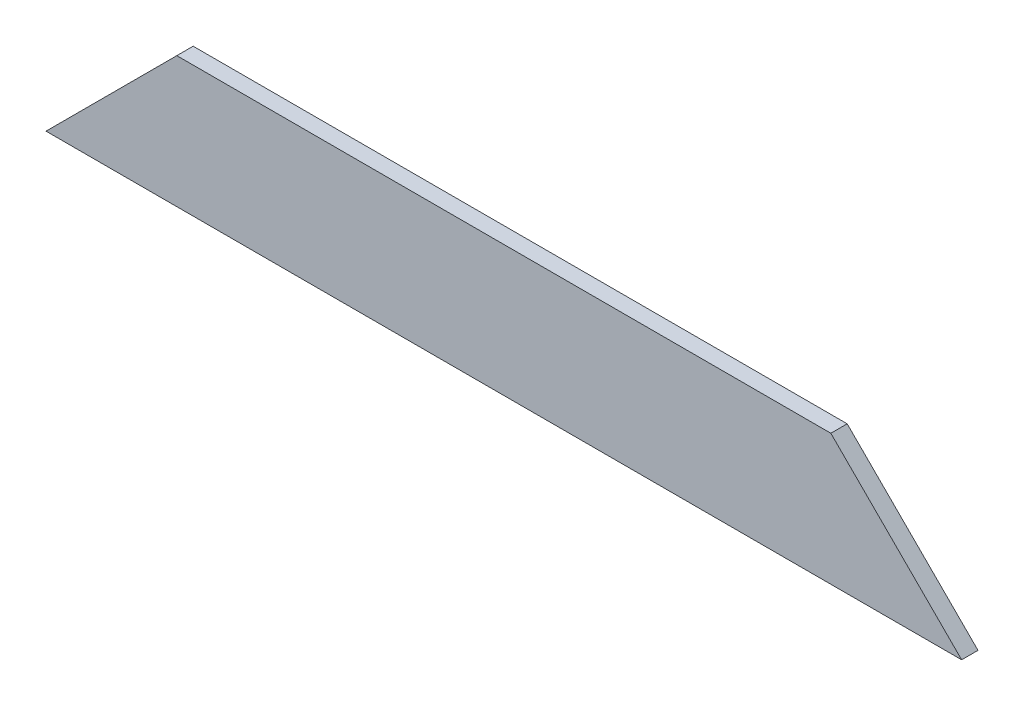
ISO-10303-21;
HEADER;
FILE_DESCRIPTION(('STEP AP214'),'2;1');
FILE_NAME('part.step','',(''),(''),'','','');
FILE_SCHEMA(('AUTOMOTIVE_DESIGN { 1 0 10303 214 1 1 1 1 }'));
ENDSEC;
DATA;
#1=APPLICATION_CONTEXT('core data for automotive mechanical design processes');
#2=APPLICATION_PROTOCOL_DEFINITION('international standard','automotive_design',2000,#1);
#3=PRODUCT_CONTEXT('',#1,'mechanical');
#4=PRODUCT('Part','Part','',(#3));
#5=PRODUCT_RELATED_PRODUCT_CATEGORY('part','',(#4));
#6=PRODUCT_DEFINITION_FORMATION('','',#4);
#7=PRODUCT_DEFINITION_CONTEXT('part definition',#1,'design');
#8=PRODUCT_DEFINITION('design','',#6,#7);
#9=PRODUCT_DEFINITION_SHAPE('','',#8);
#10=(LENGTH_UNIT() NAMED_UNIT(*) SI_UNIT(.MILLI.,.METRE.));
#11=(NAMED_UNIT(*) PLANE_ANGLE_UNIT() SI_UNIT($,.RADIAN.));
#12=(NAMED_UNIT(*) SI_UNIT($,.STERADIAN.) SOLID_ANGLE_UNIT());
#13=UNCERTAINTY_MEASURE_WITH_UNIT(LENGTH_MEASURE(1.E-05),#10,'distance_accuracy_value','');
#14=(GEOMETRIC_REPRESENTATION_CONTEXT(3) GLOBAL_UNCERTAINTY_ASSIGNED_CONTEXT((#13)) GLOBAL_UNIT_ASSIGNED_CONTEXT((#10,
#11,#12)) REPRESENTATION_CONTEXT('',''));
#15=CARTESIAN_POINT('',(0.,0.,0.));
#16=DIRECTION('',(0.,0.,1.));
#17=DIRECTION('',(1.,0.,0.));
#18=AXIS2_PLACEMENT_3D('',#15,#16,#17);
#19=CARTESIAN_POINT('',(0.,0.,3.175));
#20=DIRECTION('',(0.,0.,1.));
#21=DIRECTION('',(1.,0.,0.));
#22=AXIS2_PLACEMENT_3D('',#19,#20,#21);
#23=PLANE('',#22);
#24=DIRECTION('',(1.,0.,0.));
#25=VECTOR('',#24,1.);
#26=CARTESIAN_POINT('',(152.4,25.4,3.175));
#27=LINE('',#26,#25);
#28=CARTESIAN_POINT('',(-152.4,25.4,3.175));
#29=VERTEX_POINT('',#28);
#30=CARTESIAN_POINT('',(101.6,25.4,3.175));
#31=VERTEX_POINT('',#30);
#32=EDGE_CURVE('E68',#29,#31,#27,.T.);
#33=ORIENTED_EDGE('',*,*,#32,.F.);
#34=DIRECTION('',(-0.707106781186548,-0.707106781186548,0.));
#35=VECTOR('',#34,1.);
#36=CARTESIAN_POINT('',(-177.8,0.,3.175));
#37=LINE('',#36,#35);
#38=CARTESIAN_POINT('',(-203.2,-25.4,3.175));
#39=VERTEX_POINT('',#38);
#40=EDGE_CURVE('E20',#39,#29,#37,.F.);
#41=ORIENTED_EDGE('',*,*,#40,.F.);
#42=DIRECTION('',(1.,0.,0.));
#43=VECTOR('',#42,1.);
#44=CARTESIAN_POINT('',(-203.2,-25.4,3.175));
#45=LINE('',#44,#43);
#46=CARTESIAN_POINT('',(152.4,-25.4,3.175));
#47=VERTEX_POINT('',#46);
#48=EDGE_CURVE('E58',#47,#39,#45,.F.);
#49=ORIENTED_EDGE('',*,*,#48,.F.);
#50=DIRECTION('',(-0.707106781186548,0.707106781186548,0.));
#51=VECTOR('',#50,1.);
#52=CARTESIAN_POINT('',(127.,0.,3.175));
#53=LINE('',#52,#51);
#54=EDGE_CURVE('E53',#31,#47,#53,.F.);
#55=ORIENTED_EDGE('',*,*,#54,.F.);
#56=EDGE_LOOP('',(#33,#41,#49,#55));
#57=FACE_BOUND('',#56,.T.);
#58=ADVANCED_FACE('F17',(#57),#23,.T.);
#59=CARTESIAN_POINT('',(-177.8,0.,0.));
#60=DIRECTION('',(-0.707106781186548,0.707106781186548,0.));
#61=DIRECTION('',(-0.707106781186548,-0.707106781186548,0.));
#62=AXIS2_PLACEMENT_3D('',#59,#60,#61);
#63=PLANE('',#62);
#64=DIRECTION('',(0.,0.,1.));
#65=VECTOR('',#64,1.);
#66=CARTESIAN_POINT('',(-152.4,25.4,-3.175));
#67=LINE('',#66,#65);
#68=CARTESIAN_POINT('',(-152.4,25.4,-3.175));
#69=VERTEX_POINT('',#68);
#70=EDGE_CURVE('E81',#69,#29,#67,.T.);
#71=ORIENTED_EDGE('',*,*,#70,.F.);
#72=DIRECTION('',(-0.707106781186548,-0.707106781186547,0.));
#73=VECTOR('',#72,1.);
#74=CARTESIAN_POINT('',(-152.4,25.4,-3.175));
#75=LINE('',#74,#73);
#76=CARTESIAN_POINT('',(-203.2,-25.4,-3.175));
#77=VERTEX_POINT('',#76);
#78=EDGE_CURVE('E74',#69,#77,#75,.T.);
#79=ORIENTED_EDGE('',*,*,#78,.T.);
#80=DIRECTION('',(0.,0.,-1.));
#81=VECTOR('',#80,1.);
#82=CARTESIAN_POINT('',(-203.2,-25.4,-3.175));
#83=LINE('',#82,#81);
#84=EDGE_CURVE('E63',#39,#77,#83,.T.);
#85=ORIENTED_EDGE('',*,*,#84,.F.);
#86=ORIENTED_EDGE('',*,*,#40,.T.);
#87=EDGE_LOOP('',(#71,#79,#85,#86));
#88=FACE_BOUND('',#87,.T.);
#89=ADVANCED_FACE('F73',(#88),#63,.T.);
#90=CARTESIAN_POINT('',(-203.2,-25.4,-3.175));
#91=DIRECTION('',(0.,-1.,0.));
#92=DIRECTION('',(0.,0.,-1.));
#93=AXIS2_PLACEMENT_3D('',#90,#91,#92);
#94=PLANE('',#93);
#95=ORIENTED_EDGE('',*,*,#48,.T.);
#96=ORIENTED_EDGE('',*,*,#84,.T.);
#97=DIRECTION('',(1.,0.,0.));
#98=VECTOR('',#97,1.);
#99=CARTESIAN_POINT('',(0.,-25.4,-3.175));
#100=LINE('',#99,#98);
#101=CARTESIAN_POINT('',(152.4,-25.4,-3.175));
#102=VERTEX_POINT('',#101);
#103=EDGE_CURVE('E84',#77,#102,#100,.T.);
#104=ORIENTED_EDGE('',*,*,#103,.T.);
#105=DIRECTION('',(0.,0.,1.));
#106=VECTOR('',#105,1.);
#107=CARTESIAN_POINT('',(152.4,-25.4,0.));
#108=LINE('',#107,#106);
#109=EDGE_CURVE('E65',#47,#102,#108,.F.);
#110=ORIENTED_EDGE('',*,*,#109,.F.);
#111=EDGE_LOOP('',(#95,#96,#104,#110));
#112=FACE_BOUND('',#111,.T.);
#113=ADVANCED_FACE('F60',(#112),#94,.T.);
#114=CARTESIAN_POINT('',(127.,0.,0.));
#115=DIRECTION('',(0.707106781186548,0.707106781186548,0.));
#116=DIRECTION('',(-0.707106781186548,0.707106781186548,0.));
#117=AXIS2_PLACEMENT_3D('',#114,#115,#116);
#118=PLANE('',#117);
#119=ORIENTED_EDGE('',*,*,#109,.T.);
#120=DIRECTION('',(-0.707106781186547,0.707106781186548,0.));
#121=VECTOR('',#120,1.);
#122=CARTESIAN_POINT('',(152.4,-25.4,-3.175));
#123=LINE('',#122,#121);
#124=CARTESIAN_POINT('',(101.6,25.4,-3.175));
#125=VERTEX_POINT('',#124);
#126=EDGE_CURVE('E26',#102,#125,#123,.T.);
#127=ORIENTED_EDGE('',*,*,#126,.T.);
#128=DIRECTION('',(0.,0.,1.));
#129=VECTOR('',#128,1.);
#130=CARTESIAN_POINT('',(101.6,25.4,-3.175));
#131=LINE('',#130,#129);
#132=EDGE_CURVE('E34',#31,#125,#131,.F.);
#133=ORIENTED_EDGE('',*,*,#132,.F.);
#134=ORIENTED_EDGE('',*,*,#54,.T.);
#135=EDGE_LOOP('',(#119,#127,#133,#134));
#136=FACE_BOUND('',#135,.T.);
#137=ADVANCED_FACE('F88',(#136),#118,.T.);
#138=CARTESIAN_POINT('',(152.4,25.4,-3.175));
#139=DIRECTION('',(0.,1.,0.));
#140=DIRECTION('',(0.,0.,1.));
#141=AXIS2_PLACEMENT_3D('',#138,#139,#140);
#142=PLANE('',#141);
#143=DIRECTION('',(1.,0.,0.));
#144=VECTOR('',#143,1.);
#145=CARTESIAN_POINT('',(0.,25.4,-3.175));
#146=LINE('',#145,#144);
#147=EDGE_CURVE('E11',#125,#69,#146,.F.);
#148=ORIENTED_EDGE('',*,*,#147,.T.);
#149=ORIENTED_EDGE('',*,*,#70,.T.);
#150=ORIENTED_EDGE('',*,*,#32,.T.);
#151=ORIENTED_EDGE('',*,*,#132,.T.);
#152=EDGE_LOOP('',(#148,#149,#150,#151));
#153=FACE_BOUND('',#152,.T.);
#154=ADVANCED_FACE('F91',(#153),#142,.T.);
#155=CARTESIAN_POINT('',(0.,0.,-3.175));
#156=DIRECTION('',(0.,0.,1.));
#157=DIRECTION('',(1.,0.,0.));
#158=AXIS2_PLACEMENT_3D('',#155,#156,#157);
#159=PLANE('',#158);
#160=ORIENTED_EDGE('',*,*,#126,.F.);
#161=ORIENTED_EDGE('',*,*,#103,.F.);
#162=ORIENTED_EDGE('',*,*,#78,.F.);
#163=ORIENTED_EDGE('',*,*,#147,.F.);
#164=EDGE_LOOP('',(#160,#161,#162,#163));
#165=FACE_BOUND('',#164,.T.);
#166=ADVANCED_FACE('F90',(#165),#159,.F.);
#167=CLOSED_SHELL('',(#58,#89,#113,#137,#154,#166));
#168=MANIFOLD_SOLID_BREP('B1',#167);
#169=ADVANCED_BREP_SHAPE_REPRESENTATION('',(#18,#168),#14);
#170=SHAPE_DEFINITION_REPRESENTATION(#9,#169);
ENDSEC;
END-ISO-10303-21;
